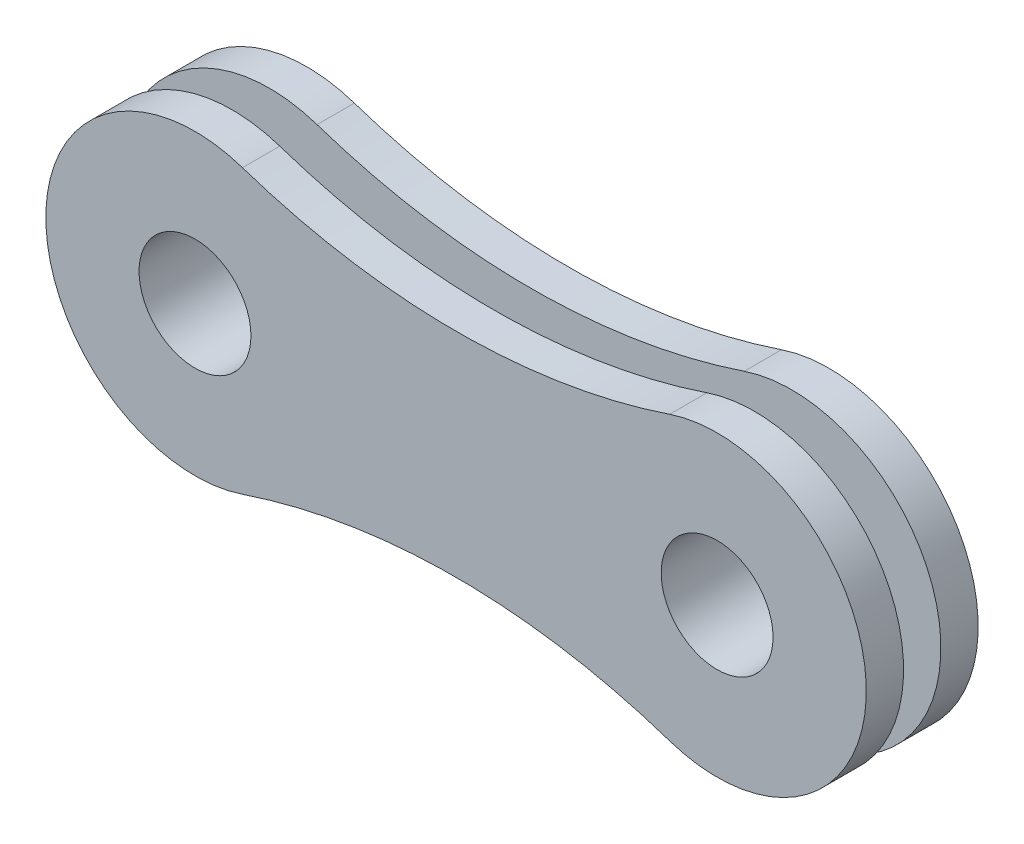
ISO-10303-21;
HEADER;
FILE_DESCRIPTION(('STEP AP214'),'2;1');
FILE_NAME('part.step','',(''),(''),'','','');
FILE_SCHEMA(('AUTOMOTIVE_DESIGN { 1 0 10303 214 1 1 1 1 }'));
ENDSEC;
DATA;
#1=APPLICATION_CONTEXT('core data for automotive mechanical design processes');
#2=APPLICATION_PROTOCOL_DEFINITION('international standard','automotive_design',2000,#1);
#3=PRODUCT_CONTEXT('',#1,'mechanical');
#4=PRODUCT('Part','Part','',(#3));
#5=PRODUCT_RELATED_PRODUCT_CATEGORY('part','',(#4));
#6=PRODUCT_DEFINITION_FORMATION('','',#4);
#7=PRODUCT_DEFINITION_CONTEXT('part definition',#1,'design');
#8=PRODUCT_DEFINITION('design','',#6,#7);
#9=PRODUCT_DEFINITION_SHAPE('','',#8);
#10=(LENGTH_UNIT() NAMED_UNIT(*) SI_UNIT(.MILLI.,.METRE.));
#11=(NAMED_UNIT(*) PLANE_ANGLE_UNIT() SI_UNIT($,.RADIAN.));
#12=(NAMED_UNIT(*) SI_UNIT($,.STERADIAN.) SOLID_ANGLE_UNIT());
#13=UNCERTAINTY_MEASURE_WITH_UNIT(LENGTH_MEASURE(1.E-05),#10,'distance_accuracy_value','');
#14=(GEOMETRIC_REPRESENTATION_CONTEXT(3) GLOBAL_UNCERTAINTY_ASSIGNED_CONTEXT((#13)) GLOBAL_UNIT_ASSIGNED_CONTEXT((#10,
#11,#12)) REPRESENTATION_CONTEXT('',''));
#15=CARTESIAN_POINT('',(0.,0.,0.));
#16=DIRECTION('',(0.,0.,1.));
#17=DIRECTION('',(1.,0.,0.));
#18=AXIS2_PLACEMENT_3D('',#15,#16,#17);
#19=CARTESIAN_POINT('',(0.,0.,1.));
#20=DIRECTION('',(0.,0.,1.));
#21=DIRECTION('',(1.,0.,0.));
#22=AXIS2_PLACEMENT_3D('',#19,#20,#21);
#23=PLANE('',#22);
#24=CARTESIAN_POINT('',(-7.,0.,1.));
#25=DIRECTION('',(0.,0.,1.));
#26=DIRECTION('',(1.,0.,0.));
#27=AXIS2_PLACEMENT_3D('',#24,#25,#26);
#28=CIRCLE('',#27,2.);
#29=CARTESIAN_POINT('',(-5.,0.,1.));
#30=VERTEX_POINT('',#29);
#31=EDGE_CURVE('E162',#30,#30,#28,.T.);
#32=ORIENTED_EDGE('',*,*,#31,.F.);
#33=EDGE_LOOP('',(#32));
#34=FACE_BOUND('',#33,.T.);
#35=CARTESIAN_POINT('',(0.,-20.8566536146142,1.));
#36=DIRECTION('',(0.,0.,1.));
#37=DIRECTION('',(1.,0.,0.));
#38=AXIS2_PLACEMENT_3D('',#35,#36,#37);
#39=CIRCLE('',#38,18.);
#40=CARTESIAN_POINT('',(5.72727272727273,-3.79211883902077,1.));
#41=VERTEX_POINT('',#40);
#42=CARTESIAN_POINT('',(-5.72727272727273,-3.79211883902078,1.));
#43=VERTEX_POINT('',#42);
#44=EDGE_CURVE('E166',#41,#43,#39,.T.);
#45=ORIENTED_EDGE('',*,*,#44,.F.);
#46=CARTESIAN_POINT('',(7.,0.,1.));
#47=DIRECTION('',(0.,0.,1.));
#48=DIRECTION('',(1.,0.,0.));
#49=AXIS2_PLACEMENT_3D('',#46,#47,#48);
#50=CIRCLE('',#49,4.);
#51=CARTESIAN_POINT('',(5.72727272727273,3.79211883902076,1.));
#52=VERTEX_POINT('',#51);
#53=EDGE_CURVE('E168',#41,#52,#50,.T.);
#54=ORIENTED_EDGE('',*,*,#53,.T.);
#55=CARTESIAN_POINT('',(0.,20.8566536146142,1.));
#56=DIRECTION('',(0.,0.,1.));
#57=DIRECTION('',(1.,0.,0.));
#58=AXIS2_PLACEMENT_3D('',#55,#56,#57);
#59=CIRCLE('',#58,18.);
#60=CARTESIAN_POINT('',(-5.72727272727273,3.79211883902076,1.));
#61=VERTEX_POINT('',#60);
#62=EDGE_CURVE('E171',#61,#52,#59,.T.);
#63=ORIENTED_EDGE('',*,*,#62,.F.);
#64=CARTESIAN_POINT('',(-7.,0.,1.));
#65=DIRECTION('',(0.,0.,1.));
#66=DIRECTION('',(1.,0.,0.));
#67=AXIS2_PLACEMENT_3D('',#64,#65,#66);
#68=CIRCLE('',#67,4.);
#69=EDGE_CURVE('E55',#61,#43,#68,.T.);
#70=ORIENTED_EDGE('',*,*,#69,.T.);
#71=EDGE_LOOP('',(#45,#54,#63,#70));
#72=FACE_BOUND('',#71,.T.);
#73=CARTESIAN_POINT('',(7.,0.,1.));
#74=DIRECTION('',(0.,0.,1.));
#75=DIRECTION('',(1.,0.,0.));
#76=AXIS2_PLACEMENT_3D('',#73,#74,#75);
#77=CIRCLE('',#76,2.);
#78=CARTESIAN_POINT('',(9.,0.,1.));
#79=VERTEX_POINT('',#78);
#80=EDGE_CURVE('E156',#79,#79,#77,.T.);
#81=ORIENTED_EDGE('',*,*,#80,.F.);
#82=EDGE_LOOP('',(#81));
#83=FACE_BOUND('',#82,.T.);
#84=ADVANCED_FACE('F37',(#34,#72,#83),#23,.T.);
#85=CARTESIAN_POINT('',(0.,-20.8566536146142,1.));
#86=DIRECTION('',(0.,0.,-1.));
#87=DIRECTION('',(-1.,0.,0.));
#88=AXIS2_PLACEMENT_3D('',#85,#86,#87);
#89=CYLINDRICAL_SURFACE('',#88,18.);
#90=CARTESIAN_POINT('',(0.,-20.8566536146142,0.));
#91=DIRECTION('',(0.,0.,1.));
#92=DIRECTION('',(1.,0.,0.));
#93=AXIS2_PLACEMENT_3D('',#90,#91,#92);
#94=CIRCLE('',#93,18.);
#95=CARTESIAN_POINT('',(5.72727272727273,-3.79211883902077,0.));
#96=VERTEX_POINT('',#95);
#97=CARTESIAN_POINT('',(-5.72727272727273,-3.79211883902078,0.));
#98=VERTEX_POINT('',#97);
#99=EDGE_CURVE('E165',#96,#98,#94,.T.);
#100=ORIENTED_EDGE('',*,*,#99,.F.);
#101=DIRECTION('',(0.,0.,-1.));
#102=VECTOR('',#101,1.);
#103=CARTESIAN_POINT('',(5.72727272727273,-3.79211883902077,1.));
#104=LINE('',#103,#102);
#105=EDGE_CURVE('E11',#41,#96,#104,.T.);
#106=ORIENTED_EDGE('',*,*,#105,.F.);
#107=ORIENTED_EDGE('',*,*,#44,.T.);
#108=DIRECTION('',(0.,0.,-1.));
#109=VECTOR('',#108,1.);
#110=CARTESIAN_POINT('',(-5.72727272727273,-3.79211883902078,1.));
#111=LINE('',#110,#109);
#112=EDGE_CURVE('E78',#43,#98,#111,.T.);
#113=ORIENTED_EDGE('',*,*,#112,.T.);
#114=EDGE_LOOP('',(#100,#106,#107,#113));
#115=FACE_BOUND('',#114,.T.);
#116=ADVANCED_FACE('F39',(#115),#89,.F.);
#117=CARTESIAN_POINT('',(7.,0.,1.));
#118=DIRECTION('',(0.,0.,-1.));
#119=DIRECTION('',(-1.,0.,0.));
#120=AXIS2_PLACEMENT_3D('',#117,#118,#119);
#121=CYLINDRICAL_SURFACE('',#120,4.);
#122=CARTESIAN_POINT('',(7.,0.,0.));
#123=DIRECTION('',(0.,0.,1.));
#124=DIRECTION('',(1.,0.,0.));
#125=AXIS2_PLACEMENT_3D('',#122,#123,#124);
#126=CIRCLE('',#125,4.);
#127=CARTESIAN_POINT('',(5.72727272727273,3.79211883902076,0.));
#128=VERTEX_POINT('',#127);
#129=EDGE_CURVE('E177',#96,#128,#126,.T.);
#130=ORIENTED_EDGE('',*,*,#129,.T.);
#131=DIRECTION('',(0.,0.,-1.));
#132=VECTOR('',#131,1.);
#133=CARTESIAN_POINT('',(5.72727272727273,3.79211883902076,1.));
#134=LINE('',#133,#132);
#135=EDGE_CURVE('E47',#52,#128,#134,.T.);
#136=ORIENTED_EDGE('',*,*,#135,.F.);
#137=ORIENTED_EDGE('',*,*,#53,.F.);
#138=ORIENTED_EDGE('',*,*,#105,.T.);
#139=EDGE_LOOP('',(#130,#136,#137,#138));
#140=FACE_BOUND('',#139,.T.);
#141=ADVANCED_FACE('F198',(#140),#121,.T.);
#142=CARTESIAN_POINT('',(0.,20.8566536146142,1.));
#143=DIRECTION('',(0.,0.,-1.));
#144=DIRECTION('',(-1.,0.,0.));
#145=AXIS2_PLACEMENT_3D('',#142,#143,#144);
#146=CYLINDRICAL_SURFACE('',#145,18.);
#147=CARTESIAN_POINT('',(0.,20.8566536146142,0.));
#148=DIRECTION('',(0.,0.,1.));
#149=DIRECTION('',(1.,0.,0.));
#150=AXIS2_PLACEMENT_3D('',#147,#148,#149);
#151=CIRCLE('',#150,18.);
#152=CARTESIAN_POINT('',(-5.72727272727273,3.79211883902076,0.));
#153=VERTEX_POINT('',#152);
#154=EDGE_CURVE('E180',#153,#128,#151,.T.);
#155=ORIENTED_EDGE('',*,*,#154,.F.);
#156=DIRECTION('',(0.,0.,-1.));
#157=VECTOR('',#156,1.);
#158=CARTESIAN_POINT('',(-5.72727272727273,3.79211883902076,1.));
#159=LINE('',#158,#157);
#160=EDGE_CURVE('E71',#61,#153,#159,.T.);
#161=ORIENTED_EDGE('',*,*,#160,.F.);
#162=ORIENTED_EDGE('',*,*,#62,.T.);
#163=ORIENTED_EDGE('',*,*,#135,.T.);
#164=EDGE_LOOP('',(#155,#161,#162,#163));
#165=FACE_BOUND('',#164,.T.);
#166=ADVANCED_FACE('F195',(#165),#146,.F.);
#167=CARTESIAN_POINT('',(7.,0.,1.));
#168=DIRECTION('',(0.,0.,-1.));
#169=DIRECTION('',(-1.,0.,0.));
#170=AXIS2_PLACEMENT_3D('',#167,#168,#169);
#171=CYLINDRICAL_SURFACE('',#170,1.5);
#172=CARTESIAN_POINT('',(7.,0.,0.));
#173=DIRECTION('',(0.,0.,1.));
#174=DIRECTION('',(1.,0.,0.));
#175=AXIS2_PLACEMENT_3D('',#172,#173,#174);
#176=CIRCLE('',#175,1.5);
#177=CARTESIAN_POINT('',(8.5,0.,0.));
#178=VERTEX_POINT('',#177);
#179=EDGE_CURVE('E185',#178,#178,#176,.T.);
#180=ORIENTED_EDGE('',*,*,#179,.F.);
#181=EDGE_LOOP('',(#180));
#182=FACE_BOUND('',#181,.T.);
#183=CARTESIAN_POINT('',(7.,0.,3.));
#184=DIRECTION('',(0.,0.,1.));
#185=DIRECTION('',(1.,0.,0.));
#186=AXIS2_PLACEMENT_3D('',#183,#184,#185);
#187=CIRCLE('',#186,1.5);
#188=CARTESIAN_POINT('',(8.5,0.,3.));
#189=VERTEX_POINT('',#188);
#190=EDGE_CURVE('E153',#189,#189,#187,.T.);
#191=ORIENTED_EDGE('',*,*,#190,.T.);
#192=EDGE_LOOP('',(#191));
#193=FACE_BOUND('',#192,.T.);
#194=ADVANCED_FACE('F234',(#182,#193),#171,.F.);
#195=CARTESIAN_POINT('',(-7.,0.,1.));
#196=DIRECTION('',(0.,0.,-1.));
#197=DIRECTION('',(-1.,0.,0.));
#198=AXIS2_PLACEMENT_3D('',#195,#196,#197);
#199=CYLINDRICAL_SURFACE('',#198,4.);
#200=CARTESIAN_POINT('',(-7.,0.,0.));
#201=DIRECTION('',(0.,0.,1.));
#202=DIRECTION('',(1.,0.,0.));
#203=AXIS2_PLACEMENT_3D('',#200,#201,#202);
#204=CIRCLE('',#203,4.);
#205=EDGE_CURVE('E183',#153,#98,#204,.T.);
#206=ORIENTED_EDGE('',*,*,#205,.T.);
#207=ORIENTED_EDGE('',*,*,#112,.F.);
#208=ORIENTED_EDGE('',*,*,#69,.F.);
#209=ORIENTED_EDGE('',*,*,#160,.T.);
#210=EDGE_LOOP('',(#206,#207,#208,#209));
#211=FACE_BOUND('',#210,.T.);
#212=ADVANCED_FACE('F202',(#211),#199,.T.);
#213=CARTESIAN_POINT('',(-7.,0.,1.));
#214=DIRECTION('',(0.,0.,-1.));
#215=DIRECTION('',(-1.,0.,0.));
#216=AXIS2_PLACEMENT_3D('',#213,#214,#215);
#217=CYLINDRICAL_SURFACE('',#216,1.5);
#218=CARTESIAN_POINT('',(-7.,0.,0.));
#219=DIRECTION('',(0.,0.,1.));
#220=DIRECTION('',(1.,0.,0.));
#221=AXIS2_PLACEMENT_3D('',#218,#219,#220);
#222=CIRCLE('',#221,1.5);
#223=CARTESIAN_POINT('',(-5.5,0.,0.));
#224=VERTEX_POINT('',#223);
#225=EDGE_CURVE('E169',#224,#224,#222,.T.);
#226=ORIENTED_EDGE('',*,*,#225,.F.);
#227=EDGE_LOOP('',(#226));
#228=FACE_BOUND('',#227,.T.);
#229=CARTESIAN_POINT('',(-7.,0.,3.));
#230=DIRECTION('',(0.,0.,1.));
#231=DIRECTION('',(1.,0.,0.));
#232=AXIS2_PLACEMENT_3D('',#229,#230,#231);
#233=CIRCLE('',#232,1.5);
#234=CARTESIAN_POINT('',(-5.5,0.,3.));
#235=VERTEX_POINT('',#234);
#236=EDGE_CURVE('E159',#235,#235,#233,.T.);
#237=ORIENTED_EDGE('',*,*,#236,.T.);
#238=EDGE_LOOP('',(#237));
#239=FACE_BOUND('',#238,.T.);
#240=ADVANCED_FACE('F230',(#228,#239),#217,.F.);
#241=CARTESIAN_POINT('',(0.,0.,0.));
#242=DIRECTION('',(0.,0.,1.));
#243=DIRECTION('',(1.,0.,0.));
#244=AXIS2_PLACEMENT_3D('',#241,#242,#243);
#245=PLANE('',#244);
#246=ORIENTED_EDGE('',*,*,#99,.T.);
#247=ORIENTED_EDGE('',*,*,#205,.F.);
#248=ORIENTED_EDGE('',*,*,#154,.T.);
#249=ORIENTED_EDGE('',*,*,#129,.F.);
#250=EDGE_LOOP('',(#246,#247,#248,#249));
#251=FACE_BOUND('',#250,.T.);
#252=ORIENTED_EDGE('',*,*,#179,.T.);
#253=EDGE_LOOP('',(#252));
#254=FACE_BOUND('',#253,.T.);
#255=ORIENTED_EDGE('',*,*,#225,.T.);
#256=EDGE_LOOP('',(#255));
#257=FACE_BOUND('',#256,.T.);
#258=ADVANCED_FACE('F200',(#251,#254,#257),#245,.F.);
#259=CARTESIAN_POINT('',(-7.,0.,3.));
#260=DIRECTION('',(0.,0.,1.));
#261=DIRECTION('',(1.,0.,0.));
#262=AXIS2_PLACEMENT_3D('',#259,#260,#261);
#263=PLANE('',#262);
#264=ORIENTED_EDGE('',*,*,#236,.F.);
#265=EDGE_LOOP('',(#264));
#266=FACE_BOUND('',#265,.T.);
#267=ORIENTED_EDGE('',*,*,#190,.F.);
#268=EDGE_LOOP('',(#267));
#269=FACE_BOUND('',#268,.T.);
#270=CARTESIAN_POINT('',(0.,-20.8566536146142,3.));
#271=DIRECTION('',(0.,0.,1.));
#272=DIRECTION('',(1.,0.,0.));
#273=AXIS2_PLACEMENT_3D('',#270,#271,#272);
#274=CIRCLE('',#273,18.);
#275=CARTESIAN_POINT('',(5.72727272727273,-3.79211883902077,3.));
#276=VERTEX_POINT('',#275);
#277=CARTESIAN_POINT('',(-5.72727272727273,-3.79211883902078,3.));
#278=VERTEX_POINT('',#277);
#279=EDGE_CURVE('E124',#276,#278,#274,.T.);
#280=ORIENTED_EDGE('',*,*,#279,.F.);
#281=CARTESIAN_POINT('',(7.,0.,3.));
#282=DIRECTION('',(0.,0.,1.));
#283=DIRECTION('',(1.,0.,0.));
#284=AXIS2_PLACEMENT_3D('',#281,#282,#283);
#285=CIRCLE('',#284,4.);
#286=CARTESIAN_POINT('',(5.72727272727273,3.79211883902076,3.));
#287=VERTEX_POINT('',#286);
#288=EDGE_CURVE('E118',#276,#287,#285,.T.);
#289=ORIENTED_EDGE('',*,*,#288,.T.);
#290=CARTESIAN_POINT('',(0.,20.8566536146142,3.));
#291=DIRECTION('',(0.,0.,1.));
#292=DIRECTION('',(1.,0.,0.));
#293=AXIS2_PLACEMENT_3D('',#290,#291,#292);
#294=CIRCLE('',#293,18.);
#295=CARTESIAN_POINT('',(-5.72727272727273,3.79211883902076,3.));
#296=VERTEX_POINT('',#295);
#297=EDGE_CURVE('E141',#296,#287,#294,.T.);
#298=ORIENTED_EDGE('',*,*,#297,.F.);
#299=CARTESIAN_POINT('',(-7.,0.,3.));
#300=DIRECTION('',(0.,0.,1.));
#301=DIRECTION('',(1.,0.,0.));
#302=AXIS2_PLACEMENT_3D('',#299,#300,#301);
#303=CIRCLE('',#302,4.);
#304=EDGE_CURVE('E139',#296,#278,#303,.T.);
#305=ORIENTED_EDGE('',*,*,#304,.T.);
#306=EDGE_LOOP('',(#280,#289,#298,#305));
#307=FACE_BOUND('',#306,.T.);
#308=ADVANCED_FACE('F219',(#266,#269,#307),#263,.T.);
#309=CARTESIAN_POINT('',(-7.,0.,3.));
#310=DIRECTION('',(0.,0.,-1.));
#311=DIRECTION('',(-1.,0.,0.));
#312=AXIS2_PLACEMENT_3D('',#309,#310,#311);
#313=CYLINDRICAL_SURFACE('',#312,2.);
#314=CARTESIAN_POINT('',(-7.,0.,2.));
#315=DIRECTION('',(0.,0.,-1.));
#316=DIRECTION('',(-1.,0.,0.));
#317=AXIS2_PLACEMENT_3D('',#314,#315,#316);
#318=CIRCLE('',#317,2.);
#319=CARTESIAN_POINT('',(-9.,0.,2.));
#320=VERTEX_POINT('',#319);
#321=EDGE_CURVE('E150',#320,#320,#318,.T.);
#322=ORIENTED_EDGE('',*,*,#321,.T.);
#323=EDGE_LOOP('',(#322));
#324=FACE_BOUND('',#323,.T.);
#325=ORIENTED_EDGE('',*,*,#31,.T.);
#326=EDGE_LOOP('',(#325));
#327=FACE_BOUND('',#326,.T.);
#328=ADVANCED_FACE('F211',(#324,#327),#313,.T.);
#329=CARTESIAN_POINT('',(7.,0.,3.));
#330=DIRECTION('',(0.,0.,-1.));
#331=DIRECTION('',(-1.,0.,0.));
#332=AXIS2_PLACEMENT_3D('',#329,#330,#331);
#333=CYLINDRICAL_SURFACE('',#332,2.);
#334=CARTESIAN_POINT('',(7.,0.,2.));
#335=DIRECTION('',(0.,0.,-1.));
#336=DIRECTION('',(-1.,0.,0.));
#337=AXIS2_PLACEMENT_3D('',#334,#335,#336);
#338=CIRCLE('',#337,2.);
#339=CARTESIAN_POINT('',(5.,0.,2.));
#340=VERTEX_POINT('',#339);
#341=EDGE_CURVE('E41',#340,#340,#338,.T.);
#342=ORIENTED_EDGE('',*,*,#341,.T.);
#343=EDGE_LOOP('',(#342));
#344=FACE_BOUND('',#343,.T.);
#345=ORIENTED_EDGE('',*,*,#80,.T.);
#346=EDGE_LOOP('',(#345));
#347=FACE_BOUND('',#346,.T.);
#348=ADVANCED_FACE('F209',(#344,#347),#333,.T.);
#349=CARTESIAN_POINT('',(0.,-20.8566536146142,2.));
#350=DIRECTION('',(0.,0.,1.));
#351=DIRECTION('',(1.,0.,0.));
#352=AXIS2_PLACEMENT_3D('',#349,#350,#351);
#353=CYLINDRICAL_SURFACE('',#352,18.);
#354=ORIENTED_EDGE('',*,*,#279,.T.);
#355=DIRECTION('',(0.,0.,1.));
#356=VECTOR('',#355,1.);
#357=CARTESIAN_POINT('',(-5.72727272727273,-3.79211883902078,2.));
#358=LINE('',#357,#356);
#359=CARTESIAN_POINT('',(-5.72727272727273,-3.79211883902078,2.));
#360=VERTEX_POINT('',#359);
#361=EDGE_CURVE('E121',#360,#278,#358,.T.);
#362=ORIENTED_EDGE('',*,*,#361,.F.);
#363=CARTESIAN_POINT('',(0.,-20.8566536146142,2.));
#364=DIRECTION('',(0.,0.,1.));
#365=DIRECTION('',(1.,0.,0.));
#366=AXIS2_PLACEMENT_3D('',#363,#364,#365);
#367=CIRCLE('',#366,18.);
#368=CARTESIAN_POINT('',(5.72727272727273,-3.79211883902077,2.));
#369=VERTEX_POINT('',#368);
#370=EDGE_CURVE('E110',#369,#360,#367,.T.);
#371=ORIENTED_EDGE('',*,*,#370,.F.);
#372=DIRECTION('',(0.,0.,1.));
#373=VECTOR('',#372,1.);
#374=CARTESIAN_POINT('',(5.72727272727273,-3.79211883902077,2.));
#375=LINE('',#374,#373);
#376=EDGE_CURVE('E137',#369,#276,#375,.T.);
#377=ORIENTED_EDGE('',*,*,#376,.T.);
#378=EDGE_LOOP('',(#354,#362,#371,#377));
#379=FACE_BOUND('',#378,.T.);
#380=ADVANCED_FACE('F122',(#379),#353,.F.);
#381=CARTESIAN_POINT('',(-7.,0.,2.));
#382=DIRECTION('',(0.,0.,1.));
#383=DIRECTION('',(1.,0.,0.));
#384=AXIS2_PLACEMENT_3D('',#381,#382,#383);
#385=CYLINDRICAL_SURFACE('',#384,4.);
#386=ORIENTED_EDGE('',*,*,#304,.F.);
#387=DIRECTION('',(0.,0.,1.));
#388=VECTOR('',#387,1.);
#389=CARTESIAN_POINT('',(-5.72727272727273,3.79211883902076,2.));
#390=LINE('',#389,#388);
#391=CARTESIAN_POINT('',(-5.72727272727273,3.79211883902076,2.));
#392=VERTEX_POINT('',#391);
#393=EDGE_CURVE('E128',#392,#296,#390,.T.);
#394=ORIENTED_EDGE('',*,*,#393,.F.);
#395=CARTESIAN_POINT('',(-7.,0.,2.));
#396=DIRECTION('',(0.,0.,1.));
#397=DIRECTION('',(1.,0.,0.));
#398=AXIS2_PLACEMENT_3D('',#395,#396,#397);
#399=CIRCLE('',#398,4.);
#400=EDGE_CURVE('E114',#392,#360,#399,.T.);
#401=ORIENTED_EDGE('',*,*,#400,.T.);
#402=ORIENTED_EDGE('',*,*,#361,.T.);
#403=EDGE_LOOP('',(#386,#394,#401,#402));
#404=FACE_BOUND('',#403,.T.);
#405=ADVANCED_FACE('F130',(#404),#385,.T.);
#406=CARTESIAN_POINT('',(0.,20.8566536146142,2.));
#407=DIRECTION('',(0.,0.,1.));
#408=DIRECTION('',(1.,0.,0.));
#409=AXIS2_PLACEMENT_3D('',#406,#407,#408);
#410=CYLINDRICAL_SURFACE('',#409,18.);
#411=ORIENTED_EDGE('',*,*,#297,.T.);
#412=DIRECTION('',(0.,0.,1.));
#413=VECTOR('',#412,1.);
#414=CARTESIAN_POINT('',(5.72727272727273,3.79211883902076,2.));
#415=LINE('',#414,#413);
#416=CARTESIAN_POINT('',(5.72727272727273,3.79211883902076,2.));
#417=VERTEX_POINT('',#416);
#418=EDGE_CURVE('E147',#417,#287,#415,.T.);
#419=ORIENTED_EDGE('',*,*,#418,.F.);
#420=CARTESIAN_POINT('',(0.,20.8566536146142,2.));
#421=DIRECTION('',(0.,0.,1.));
#422=DIRECTION('',(1.,0.,0.));
#423=AXIS2_PLACEMENT_3D('',#420,#421,#422);
#424=CIRCLE('',#423,18.);
#425=EDGE_CURVE('E132',#392,#417,#424,.T.);
#426=ORIENTED_EDGE('',*,*,#425,.F.);
#427=ORIENTED_EDGE('',*,*,#393,.T.);
#428=EDGE_LOOP('',(#411,#419,#426,#427));
#429=FACE_BOUND('',#428,.T.);
#430=ADVANCED_FACE('F304',(#429),#410,.F.);
#431=CARTESIAN_POINT('',(7.,0.,2.));
#432=DIRECTION('',(0.,0.,1.));
#433=DIRECTION('',(1.,0.,0.));
#434=AXIS2_PLACEMENT_3D('',#431,#432,#433);
#435=CYLINDRICAL_SURFACE('',#434,4.);
#436=ORIENTED_EDGE('',*,*,#288,.F.);
#437=ORIENTED_EDGE('',*,*,#376,.F.);
#438=CARTESIAN_POINT('',(7.,0.,2.));
#439=DIRECTION('',(0.,0.,1.));
#440=DIRECTION('',(1.,0.,0.));
#441=AXIS2_PLACEMENT_3D('',#438,#439,#440);
#442=CIRCLE('',#441,4.);
#443=EDGE_CURVE('E116',#369,#417,#442,.T.);
#444=ORIENTED_EDGE('',*,*,#443,.T.);
#445=ORIENTED_EDGE('',*,*,#418,.T.);
#446=EDGE_LOOP('',(#436,#437,#444,#445));
#447=FACE_BOUND('',#446,.T.);
#448=ADVANCED_FACE('F312',(#447),#435,.T.);
#449=CARTESIAN_POINT('',(0.,0.,2.));
#450=DIRECTION('',(0.,0.,-1.));
#451=DIRECTION('',(1.,0.,0.));
#452=AXIS2_PLACEMENT_3D('',#449,#450,#451);
#453=PLANE('',#452);
#454=ORIENTED_EDGE('',*,*,#321,.F.);
#455=EDGE_LOOP('',(#454));
#456=FACE_BOUND('',#455,.T.);
#457=ORIENTED_EDGE('',*,*,#341,.F.);
#458=EDGE_LOOP('',(#457));
#459=FACE_BOUND('',#458,.T.);
#460=ORIENTED_EDGE('',*,*,#370,.T.);
#461=ORIENTED_EDGE('',*,*,#400,.F.);
#462=ORIENTED_EDGE('',*,*,#425,.T.);
#463=ORIENTED_EDGE('',*,*,#443,.F.);
#464=EDGE_LOOP('',(#460,#461,#462,#463));
#465=FACE_BOUND('',#464,.T.);
#466=ADVANCED_FACE('F112',(#456,#459,#465),#453,.T.);
#467=CLOSED_SHELL('',(#84,#116,#141,#166,#194,#212,#240,#258,#308,#328,#348,#380,#405,#430,#448,#466));
#468=MANIFOLD_SOLID_BREP('B2',#467);
#469=ADVANCED_BREP_SHAPE_REPRESENTATION('',(#18,#468),#14);
#470=SHAPE_DEFINITION_REPRESENTATION(#9,#469);
ENDSEC;
END-ISO-10303-21;
